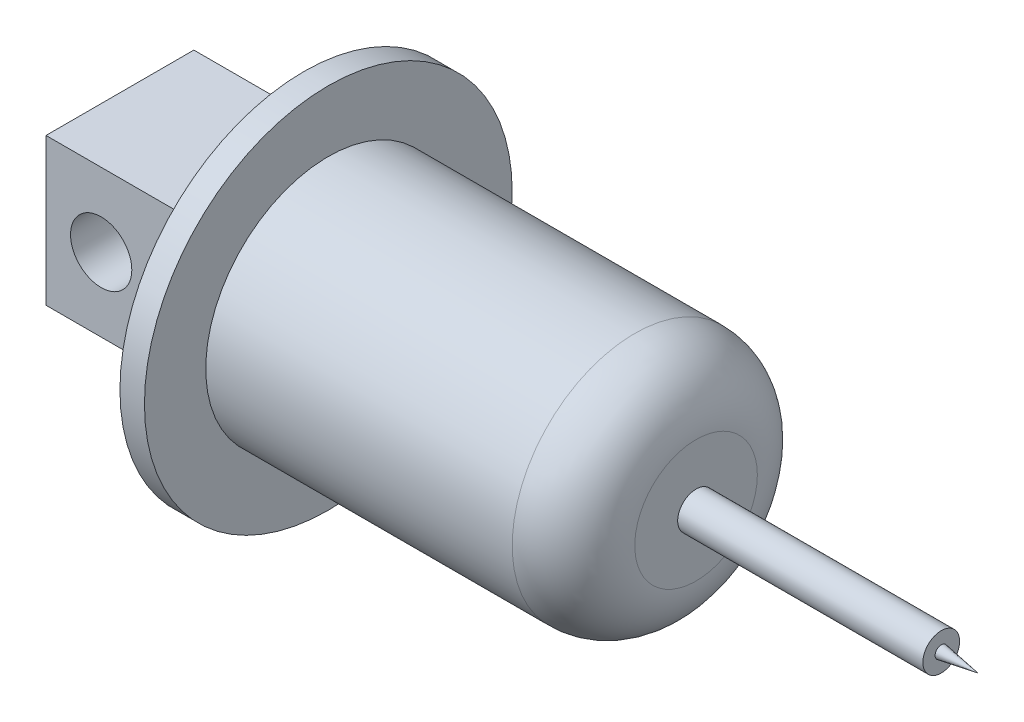
ISO-10303-21;
HEADER;
FILE_DESCRIPTION(('STEP AP214'),'2;1');
FILE_NAME('part.step','',(''),(''),'','','');
FILE_SCHEMA(('AUTOMOTIVE_DESIGN { 1 0 10303 214 1 1 1 1 }'));
ENDSEC;
DATA;
#1=APPLICATION_CONTEXT('core data for automotive mechanical design processes');
#2=APPLICATION_PROTOCOL_DEFINITION('international standard','automotive_design',2000,#1);
#3=PRODUCT_CONTEXT('',#1,'mechanical');
#4=PRODUCT('Part','Part','',(#3));
#5=PRODUCT_RELATED_PRODUCT_CATEGORY('part','',(#4));
#6=PRODUCT_DEFINITION_FORMATION('','',#4);
#7=PRODUCT_DEFINITION_CONTEXT('part definition',#1,'design');
#8=PRODUCT_DEFINITION('design','',#6,#7);
#9=PRODUCT_DEFINITION_SHAPE('','',#8);
#10=(LENGTH_UNIT() NAMED_UNIT(*) SI_UNIT(.MILLI.,.METRE.));
#11=(NAMED_UNIT(*) PLANE_ANGLE_UNIT() SI_UNIT($,.RADIAN.));
#12=(NAMED_UNIT(*) SI_UNIT($,.STERADIAN.) SOLID_ANGLE_UNIT());
#13=UNCERTAINTY_MEASURE_WITH_UNIT(LENGTH_MEASURE(1.E-05),#10,'distance_accuracy_value','');
#14=(GEOMETRIC_REPRESENTATION_CONTEXT(3) GLOBAL_UNCERTAINTY_ASSIGNED_CONTEXT((#13)) GLOBAL_UNIT_ASSIGNED_CONTEXT((#10,
#11,#12)) REPRESENTATION_CONTEXT('',''));
#15=CARTESIAN_POINT('',(0.,0.,0.));
#16=DIRECTION('',(0.,0.,1.));
#17=DIRECTION('',(1.,0.,0.));
#18=AXIS2_PLACEMENT_3D('',#15,#16,#17);
#19=CARTESIAN_POINT('',(-20.,0.,0.));
#20=DIRECTION('',(-1.,0.,0.));
#21=DIRECTION('',(0.,0.,1.));
#22=AXIS2_PLACEMENT_3D('',#19,#20,#21);
#23=CYLINDRICAL_SURFACE('',#22,10.);
#24=CARTESIAN_POINT('',(-25.,0.,0.));
#25=DIRECTION('',(1.,0.,0.));
#26=DIRECTION('',(0.,0.,-1.));
#27=AXIS2_PLACEMENT_3D('',#24,#25,#26);
#28=CIRCLE('',#27,10.);
#29=CARTESIAN_POINT('',(-25.,0.,-9.99999999999991));
#30=VERTEX_POINT('',#29);
#31=EDGE_CURVE('E11',#30,#30,#28,.F.);
#32=ORIENTED_EDGE('',*,*,#31,.T.);
#33=EDGE_LOOP('',(#32));
#34=FACE_BOUND('',#33,.T.);
#35=CARTESIAN_POINT('',(-50.,0.,1.74894432217042E-13));
#36=DIRECTION('',(1.,0.,0.));
#37=DIRECTION('',(0.,0.,-1.));
#38=AXIS2_PLACEMENT_3D('',#35,#36,#37);
#39=CIRCLE('',#38,10.);
#40=CARTESIAN_POINT('',(-50.,0.,-9.99999999999982));
#41=VERTEX_POINT('',#40);
#42=EDGE_CURVE('E170',#41,#41,#39,.T.);
#43=ORIENTED_EDGE('',*,*,#42,.T.);
#44=EDGE_LOOP('',(#43));
#45=FACE_BOUND('',#44,.T.);
#46=ADVANCED_FACE('F37',(#34,#45),#23,.T.);
#47=CARTESIAN_POINT('',(-20.,0.,0.));
#48=DIRECTION('',(1.,0.,0.));
#49=DIRECTION('',(0.,0.,-1.));
#50=AXIS2_PLACEMENT_3D('',#47,#48,#49);
#51=PLANE('',#50);
#52=CARTESIAN_POINT('',(-20.,0.,0.));
#53=DIRECTION('',(1.,0.,0.));
#54=DIRECTION('',(0.,0.,-1.));
#55=AXIS2_PLACEMENT_3D('',#52,#53,#54);
#56=CIRCLE('',#55,1.5);
#57=CARTESIAN_POINT('',(-20.,0.,-1.49999999999993));
#58=VERTEX_POINT('',#57);
#59=EDGE_CURVE('E153',#58,#58,#56,.T.);
#60=ORIENTED_EDGE('',*,*,#59,.F.);
#61=EDGE_LOOP('',(#60));
#62=FACE_BOUND('',#61,.T.);
#63=CARTESIAN_POINT('',(-20.,0.,0.));
#64=DIRECTION('',(1.,0.,0.));
#65=DIRECTION('',(0.,0.,-1.));
#66=AXIS2_PLACEMENT_3D('',#63,#64,#65);
#67=CIRCLE('',#66,5.);
#68=CARTESIAN_POINT('',(-20.,0.,-4.99999999999993));
#69=VERTEX_POINT('',#68);
#70=EDGE_CURVE('E45',#69,#69,#67,.T.);
#71=ORIENTED_EDGE('',*,*,#70,.T.);
#72=EDGE_LOOP('',(#71));
#73=FACE_BOUND('',#72,.T.);
#74=ADVANCED_FACE('F90',(#62,#73),#51,.T.);
#75=CARTESIAN_POINT('',(-52.,0.,1.81877394894729E-13));
#76=DIRECTION('',(1.,0.,0.));
#77=DIRECTION('',(0.,0.,-1.));
#78=AXIS2_PLACEMENT_3D('',#75,#76,#77);
#79=CYLINDRICAL_SURFACE('',#78,15.);
#80=CARTESIAN_POINT('',(-52.,0.,1.81877394894729E-13));
#81=DIRECTION('',(-1.,0.,0.));
#82=DIRECTION('',(0.,0.,1.));
#83=AXIS2_PLACEMENT_3D('',#80,#81,#82);
#84=CIRCLE('',#83,15.);
#85=CARTESIAN_POINT('',(-52.,0.,15.0000000000002));
#86=VERTEX_POINT('',#85);
#87=EDGE_CURVE('E167',#86,#86,#84,.T.);
#88=ORIENTED_EDGE('',*,*,#87,.F.);
#89=EDGE_LOOP('',(#88));
#90=FACE_BOUND('',#89,.T.);
#91=CARTESIAN_POINT('',(-50.,0.,1.74894432217042E-13));
#92=DIRECTION('',(-1.,0.,0.));
#93=DIRECTION('',(0.,0.,1.));
#94=AXIS2_PLACEMENT_3D('',#91,#92,#93);
#95=CIRCLE('',#94,15.);
#96=CARTESIAN_POINT('',(-50.,0.,15.0000000000002));
#97=VERTEX_POINT('',#96);
#98=EDGE_CURVE('E165',#97,#97,#95,.T.);
#99=ORIENTED_EDGE('',*,*,#98,.T.);
#100=EDGE_LOOP('',(#99));
#101=FACE_BOUND('',#100,.T.);
#102=ADVANCED_FACE('F95',(#90,#101),#79,.T.);
#103=CARTESIAN_POINT('',(-52.,0.,1.81877394894729E-13));
#104=DIRECTION('',(-1.,0.,0.));
#105=DIRECTION('',(0.,0.,1.));
#106=AXIS2_PLACEMENT_3D('',#103,#104,#105);
#107=PLANE('',#106);
#108=DIRECTION('',(0.,-1.,0.));
#109=VECTOR('',#108,1.);
#110=CARTESIAN_POINT('',(-52.,-6.,-6.03128939533191));
#111=LINE('',#110,#109);
#112=CARTESIAN_POINT('',(-52.,6.,-6.03128939533191));
#113=VERTEX_POINT('',#112);
#114=CARTESIAN_POINT('',(-52.,-6.,-6.03128939533191));
#115=VERTEX_POINT('',#114);
#116=EDGE_CURVE('E52',#113,#115,#111,.T.);
#117=ORIENTED_EDGE('',*,*,#116,.F.);
#118=DIRECTION('',(0.,0.,-1.));
#119=VECTOR('',#118,1.);
#120=CARTESIAN_POINT('',(-52.,6.,6.03128939533228));
#121=LINE('',#120,#119);
#122=CARTESIAN_POINT('',(-52.,6.,6.03128939533228));
#123=VERTEX_POINT('',#122);
#124=EDGE_CURVE('E56',#123,#113,#121,.T.);
#125=ORIENTED_EDGE('',*,*,#124,.F.);
#126=DIRECTION('',(0.,1.,0.));
#127=VECTOR('',#126,1.);
#128=CARTESIAN_POINT('',(-52.,-6.,6.03128939533228));
#129=LINE('',#128,#127);
#130=CARTESIAN_POINT('',(-52.,-6.,6.03128939533228));
#131=VERTEX_POINT('',#130);
#132=EDGE_CURVE('E280',#131,#123,#129,.T.);
#133=ORIENTED_EDGE('',*,*,#132,.F.);
#134=DIRECTION('',(0.,0.,1.));
#135=VECTOR('',#134,1.);
#136=CARTESIAN_POINT('',(-52.,-6.,6.03128939533228));
#137=LINE('',#136,#135);
#138=EDGE_CURVE('E282',#115,#131,#137,.T.);
#139=ORIENTED_EDGE('',*,*,#138,.F.);
#140=EDGE_LOOP('',(#117,#125,#133,#139));
#141=FACE_BOUND('',#140,.T.);
#142=ORIENTED_EDGE('',*,*,#87,.T.);
#143=EDGE_LOOP('',(#142));
#144=FACE_BOUND('',#143,.T.);
#145=ADVANCED_FACE('F102',(#141,#144),#107,.T.);
#146=CARTESIAN_POINT('',(-50.,0.,1.74894432217042E-13));
#147=DIRECTION('',(-1.,0.,0.));
#148=DIRECTION('',(0.,0.,1.));
#149=AXIS2_PLACEMENT_3D('',#146,#147,#148);
#150=PLANE('',#149);
#151=ORIENTED_EDGE('',*,*,#42,.F.);
#152=EDGE_LOOP('',(#151));
#153=FACE_BOUND('',#152,.T.);
#154=ORIENTED_EDGE('',*,*,#98,.F.);
#155=EDGE_LOOP('',(#154));
#156=FACE_BOUND('',#155,.T.);
#157=ADVANCED_FACE('F104',(#153,#156),#150,.F.);
#158=CARTESIAN_POINT('',(-25.,0.,0.));
#159=DIRECTION('',(1.,0.,0.));
#160=DIRECTION('',(0.,0.,-1.));
#161=AXIS2_PLACEMENT_3D('',#158,#159,#160);
#162=DEGENERATE_TOROIDAL_SURFACE('',#161,5.,5.,.T.);
#163=ORIENTED_EDGE('',*,*,#31,.F.);
#164=EDGE_LOOP('',(#163));
#165=FACE_BOUND('',#164,.T.);
#166=ORIENTED_EDGE('',*,*,#70,.F.);
#167=EDGE_LOOP('',(#166));
#168=FACE_BOUND('',#167,.T.);
#169=ADVANCED_FACE('F39',(#165,#168),#162,.T.);
#170=CARTESIAN_POINT('',(0.,0.,0.));
#171=DIRECTION('',(-1.,0.,0.));
#172=DIRECTION('',(0.,0.,1.));
#173=AXIS2_PLACEMENT_3D('',#170,#171,#172);
#174=CYLINDRICAL_SURFACE('',#173,1.5);
#175=CARTESIAN_POINT('',(0.,0.,0.));
#176=DIRECTION('',(1.,0.,0.));
#177=DIRECTION('',(0.,0.,-1.));
#178=AXIS2_PLACEMENT_3D('',#175,#176,#177);
#179=CIRCLE('',#178,1.5);
#180=CARTESIAN_POINT('',(0.,0.,-1.5));
#181=VERTEX_POINT('',#180);
#182=EDGE_CURVE('E157',#181,#181,#179,.T.);
#183=ORIENTED_EDGE('',*,*,#182,.F.);
#184=EDGE_LOOP('',(#183));
#185=FACE_BOUND('',#184,.T.);
#186=ORIENTED_EDGE('',*,*,#59,.T.);
#187=EDGE_LOOP('',(#186));
#188=FACE_BOUND('',#187,.T.);
#189=ADVANCED_FACE('F110',(#185,#188),#174,.T.);
#190=CARTESIAN_POINT('',(0.,0.,0.));
#191=DIRECTION('',(1.,0.,0.));
#192=DIRECTION('',(0.,0.,-1.));
#193=AXIS2_PLACEMENT_3D('',#190,#191,#192);
#194=PLANE('',#193);
#195=CARTESIAN_POINT('',(0.,0.,0.));
#196=DIRECTION('',(-1.,0.,0.));
#197=DIRECTION('',(0.,0.,1.));
#198=AXIS2_PLACEMENT_3D('',#195,#196,#197);
#199=CIRCLE('',#198,0.5);
#200=CARTESIAN_POINT('',(0.,0.,0.5));
#201=VERTEX_POINT('',#200);
#202=EDGE_CURVE('E295',#201,#201,#199,.T.);
#203=ORIENTED_EDGE('',*,*,#202,.T.);
#204=EDGE_LOOP('',(#203));
#205=FACE_BOUND('',#204,.T.);
#206=ORIENTED_EDGE('',*,*,#182,.T.);
#207=EDGE_LOOP('',(#206));
#208=FACE_BOUND('',#207,.T.);
#209=ADVANCED_FACE('F113',(#205,#208),#194,.T.);
#210=CARTESIAN_POINT('',(-67.,-6.,-6.03128939533186));
#211=DIRECTION('',(0.,0.,1.));
#212=DIRECTION('',(1.,0.,0.));
#213=AXIS2_PLACEMENT_3D('',#210,#211,#212);
#214=PLANE('',#213);
#215=CARTESIAN_POINT('',(-62.5,0.,-6.03128939533188));
#216=DIRECTION('',(0.,0.,1.));
#217=DIRECTION('',(1.,0.,0.));
#218=AXIS2_PLACEMENT_3D('',#215,#216,#217);
#219=CIRCLE('',#218,2.5);
#220=CARTESIAN_POINT('',(-60.,0.,-6.03128939533189));
#221=VERTEX_POINT('',#220);
#222=EDGE_CURVE('E285',#221,#221,#219,.T.);
#223=ORIENTED_EDGE('',*,*,#222,.T.);
#224=EDGE_LOOP('',(#223));
#225=FACE_BOUND('',#224,.T.);
#226=ORIENTED_EDGE('',*,*,#116,.T.);
#227=DIRECTION('',(1.,0.,0.));
#228=VECTOR('',#227,1.);
#229=CARTESIAN_POINT('',(-67.,-6.,-6.03128939533186));
#230=LINE('',#229,#228);
#231=CARTESIAN_POINT('',(-67.,-6.,-6.03128939533186));
#232=VERTEX_POINT('',#231);
#233=EDGE_CURVE('E151',#232,#115,#230,.T.);
#234=ORIENTED_EDGE('',*,*,#233,.F.);
#235=DIRECTION('',(0.,-1.,0.));
#236=VECTOR('',#235,1.);
#237=CARTESIAN_POINT('',(-67.,-6.,-6.03128939533186));
#238=LINE('',#237,#236);
#239=CARTESIAN_POINT('',(-67.,6.,-6.03128939533186));
#240=VERTEX_POINT('',#239);
#241=EDGE_CURVE('E140',#240,#232,#238,.T.);
#242=ORIENTED_EDGE('',*,*,#241,.F.);
#243=DIRECTION('',(1.,0.,0.));
#244=VECTOR('',#243,1.);
#245=CARTESIAN_POINT('',(-67.,6.,-6.03128939533186));
#246=LINE('',#245,#244);
#247=EDGE_CURVE('E277',#240,#113,#246,.T.);
#248=ORIENTED_EDGE('',*,*,#247,.T.);
#249=EDGE_LOOP('',(#226,#234,#242,#248));
#250=FACE_BOUND('',#249,.T.);
#251=ADVANCED_FACE('F117',(#225,#250),#214,.F.);
#252=CARTESIAN_POINT('',(-67.,-6.,6.03128939533233));
#253=DIRECTION('',(0.,1.,0.));
#254=DIRECTION('',(0.,0.,1.));
#255=AXIS2_PLACEMENT_3D('',#252,#253,#254);
#256=PLANE('',#255);
#257=ORIENTED_EDGE('',*,*,#138,.T.);
#258=DIRECTION('',(1.,0.,0.));
#259=VECTOR('',#258,1.);
#260=CARTESIAN_POINT('',(-67.,-6.,6.03128939533233));
#261=LINE('',#260,#259);
#262=CARTESIAN_POINT('',(-67.,-6.,6.03128939533233));
#263=VERTEX_POINT('',#262);
#264=EDGE_CURVE('E154',#263,#131,#261,.T.);
#265=ORIENTED_EDGE('',*,*,#264,.F.);
#266=DIRECTION('',(0.,0.,1.));
#267=VECTOR('',#266,1.);
#268=CARTESIAN_POINT('',(-67.,-6.,6.03128939533233));
#269=LINE('',#268,#267);
#270=EDGE_CURVE('E142',#232,#263,#269,.T.);
#271=ORIENTED_EDGE('',*,*,#270,.F.);
#272=ORIENTED_EDGE('',*,*,#233,.T.);
#273=EDGE_LOOP('',(#257,#265,#271,#272));
#274=FACE_BOUND('',#273,.T.);
#275=ADVANCED_FACE('F121',(#274),#256,.F.);
#276=CARTESIAN_POINT('',(-67.,-6.,6.03128939533233));
#277=DIRECTION('',(0.,0.,-1.));
#278=DIRECTION('',(-1.,0.,0.));
#279=AXIS2_PLACEMENT_3D('',#276,#277,#278);
#280=PLANE('',#279);
#281=CARTESIAN_POINT('',(-62.5,0.,6.03128939533231));
#282=DIRECTION('',(0.,0.,1.));
#283=DIRECTION('',(1.,0.,0.));
#284=AXIS2_PLACEMENT_3D('',#281,#282,#283);
#285=CIRCLE('',#284,2.5);
#286=CARTESIAN_POINT('',(-60.,0.,6.0312893953323));
#287=VERTEX_POINT('',#286);
#288=EDGE_CURVE('E292',#287,#287,#285,.T.);
#289=ORIENTED_EDGE('',*,*,#288,.F.);
#290=EDGE_LOOP('',(#289));
#291=FACE_BOUND('',#290,.T.);
#292=ORIENTED_EDGE('',*,*,#132,.T.);
#293=DIRECTION('',(1.,0.,0.));
#294=VECTOR('',#293,1.);
#295=CARTESIAN_POINT('',(-67.,6.,6.03128939533233));
#296=LINE('',#295,#294);
#297=CARTESIAN_POINT('',(-67.,6.,6.03128939533233));
#298=VERTEX_POINT('',#297);
#299=EDGE_CURVE('E160',#298,#123,#296,.T.);
#300=ORIENTED_EDGE('',*,*,#299,.F.);
#301=DIRECTION('',(0.,1.,0.));
#302=VECTOR('',#301,1.);
#303=CARTESIAN_POINT('',(-67.,-6.,6.03128939533233));
#304=LINE('',#303,#302);
#305=EDGE_CURVE('E287',#263,#298,#304,.T.);
#306=ORIENTED_EDGE('',*,*,#305,.F.);
#307=ORIENTED_EDGE('',*,*,#264,.T.);
#308=EDGE_LOOP('',(#292,#300,#306,#307));
#309=FACE_BOUND('',#308,.T.);
#310=ADVANCED_FACE('F125',(#291,#309),#280,.F.);
#311=CARTESIAN_POINT('',(-67.,6.,6.03128939533233));
#312=DIRECTION('',(0.,-1.,0.));
#313=DIRECTION('',(0.,0.,-1.));
#314=AXIS2_PLACEMENT_3D('',#311,#312,#313);
#315=PLANE('',#314);
#316=ORIENTED_EDGE('',*,*,#124,.T.);
#317=ORIENTED_EDGE('',*,*,#247,.F.);
#318=DIRECTION('',(0.,0.,-1.));
#319=VECTOR('',#318,1.);
#320=CARTESIAN_POINT('',(-67.,6.,6.03128939533233));
#321=LINE('',#320,#319);
#322=EDGE_CURVE('E145',#298,#240,#321,.T.);
#323=ORIENTED_EDGE('',*,*,#322,.F.);
#324=ORIENTED_EDGE('',*,*,#299,.T.);
#325=EDGE_LOOP('',(#316,#317,#323,#324));
#326=FACE_BOUND('',#325,.T.);
#327=ADVANCED_FACE('F129',(#326),#315,.F.);
#328=CARTESIAN_POINT('',(-67.,0.,2.34249614977376E-13));
#329=DIRECTION('',(-1.,0.,0.));
#330=DIRECTION('',(0.,0.,1.));
#331=AXIS2_PLACEMENT_3D('',#328,#329,#330);
#332=PLANE('',#331);
#333=ORIENTED_EDGE('',*,*,#241,.T.);
#334=ORIENTED_EDGE('',*,*,#270,.T.);
#335=ORIENTED_EDGE('',*,*,#305,.T.);
#336=ORIENTED_EDGE('',*,*,#322,.T.);
#337=EDGE_LOOP('',(#333,#334,#335,#336));
#338=FACE_BOUND('',#337,.T.);
#339=ADVANCED_FACE('F85',(#338),#332,.T.);
#340=CARTESIAN_POINT('',(-62.5000000000001,0.,-14.9999999999998));
#341=DIRECTION('',(0.,0.,1.));
#342=DIRECTION('',(1.,0.,0.));
#343=AXIS2_PLACEMENT_3D('',#340,#341,#342);
#344=CYLINDRICAL_SURFACE('',#343,2.5);
#345=ORIENTED_EDGE('',*,*,#288,.T.);
#346=EDGE_LOOP('',(#345));
#347=FACE_BOUND('',#346,.T.);
#348=ORIENTED_EDGE('',*,*,#222,.F.);
#349=EDGE_LOOP('',(#348));
#350=FACE_BOUND('',#349,.T.);
#351=ADVANCED_FACE('F79',(#347,#350),#344,.F.);
#352=CARTESIAN_POINT('',(3.,0.,0.));
#353=DIRECTION('',(-1.,0.,0.));
#354=DIRECTION('',(0.,0.,1.));
#355=AXIS2_PLACEMENT_3D('',#352,#353,#354);
#356=CONICAL_SURFACE('',#355,0.,0.165148677414627);
#357=ORIENTED_EDGE('',*,*,#202,.F.);
#358=EDGE_LOOP('',(#357));
#359=FACE_BOUND('',#358,.T.);
#360=CARTESIAN_POINT('',(3.,0.,0.));
#361=VERTEX_POINT('',#360);
#362=VERTEX_LOOP('',#361);
#363=FACE_BOUND('',#362,.T.);
#364=ADVANCED_FACE('F77',(#359,#363),#356,.T.);
#365=CLOSED_SHELL('',(#46,#74,#102,#145,#157,#169,#189,#209,#251,#275,#310,#327,#339,#351,#364));
#366=MANIFOLD_SOLID_BREP('B2',#365);
#367=ADVANCED_BREP_SHAPE_REPRESENTATION('',(#18,#366),#14);
#368=SHAPE_DEFINITION_REPRESENTATION(#9,#367);
ENDSEC;
END-ISO-10303-21;
